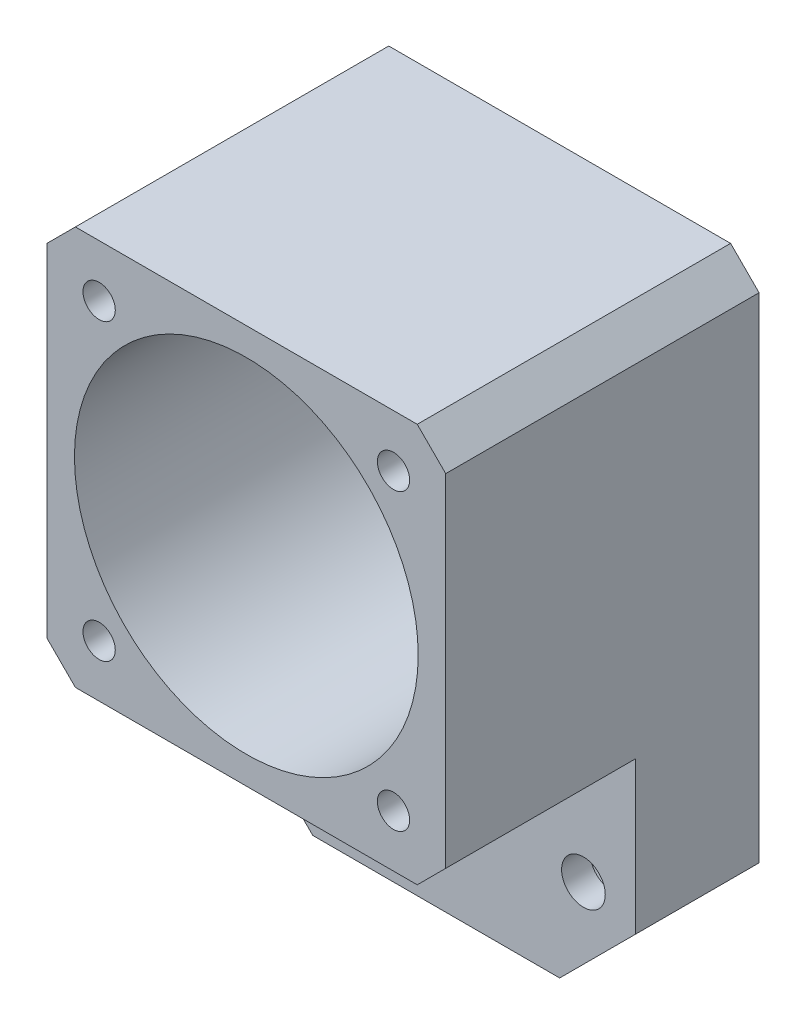
ISO-10303-21;
HEADER;
FILE_DESCRIPTION(('STEP AP214'),'2;1');
FILE_NAME('part.step','',(''),(''),'','','');
FILE_SCHEMA(('AUTOMOTIVE_DESIGN { 1 0 10303 214 1 1 1 1 }'));
ENDSEC;
DATA;
#1=APPLICATION_CONTEXT('core data for automotive mechanical design processes');
#2=APPLICATION_PROTOCOL_DEFINITION('international standard','automotive_design',2000,#1);
#3=PRODUCT_CONTEXT('',#1,'mechanical');
#4=PRODUCT('Part','Part','',(#3));
#5=PRODUCT_RELATED_PRODUCT_CATEGORY('part','',(#4));
#6=PRODUCT_DEFINITION_FORMATION('','',#4);
#7=PRODUCT_DEFINITION_CONTEXT('part definition',#1,'design');
#8=PRODUCT_DEFINITION('design','',#6,#7);
#9=PRODUCT_DEFINITION_SHAPE('','',#8);
#10=(LENGTH_UNIT() NAMED_UNIT(*) SI_UNIT(.MILLI.,.METRE.));
#11=(NAMED_UNIT(*) PLANE_ANGLE_UNIT() SI_UNIT($,.RADIAN.));
#12=(NAMED_UNIT(*) SI_UNIT($,.STERADIAN.) SOLID_ANGLE_UNIT());
#13=UNCERTAINTY_MEASURE_WITH_UNIT(LENGTH_MEASURE(1.E-05),#10,'distance_accuracy_value','');
#14=(GEOMETRIC_REPRESENTATION_CONTEXT(3) GLOBAL_UNCERTAINTY_ASSIGNED_CONTEXT((#13)) GLOBAL_UNIT_ASSIGNED_CONTEXT((#10,
#11,#12)) REPRESENTATION_CONTEXT('',''));
#15=CARTESIAN_POINT('',(0.,0.,0.));
#16=DIRECTION('',(0.,0.,1.));
#17=DIRECTION('',(1.,0.,0.));
#18=AXIS2_PLACEMENT_3D('',#15,#16,#17);
#19=CARTESIAN_POINT('',(0.,0.,13.));
#20=DIRECTION('',(0.,0.,1.));
#21=DIRECTION('',(1.,0.,0.));
#22=AXIS2_PLACEMENT_3D('',#19,#20,#21);
#23=PLANE('',#22);
#24=DIRECTION('',(0.,-1.,0.));
#25=VECTOR('',#24,1.);
#26=CARTESIAN_POINT('',(-21.,21.,13.));
#27=LINE('',#26,#25);
#28=CARTESIAN_POINT('',(-21.,-18.,13.));
#29=VERTEX_POINT('',#28);
#30=CARTESIAN_POINT('',(-21.,-34.,13.));
#31=VERTEX_POINT('',#30);
#32=EDGE_CURVE('E174',#29,#31,#27,.T.);
#33=ORIENTED_EDGE('',*,*,#32,.T.);
#34=DIRECTION('',(-0.707106781186546,0.707106781186549,0.));
#35=VECTOR('',#34,1.);
#36=CARTESIAN_POINT('',(-27.5,-27.4999999999999,13.));
#37=LINE('',#36,#35);
#38=CARTESIAN_POINT('',(-13.,-42.,13.));
#39=VERTEX_POINT('',#38);
#40=EDGE_CURVE('E45',#31,#39,#37,.F.);
#41=ORIENTED_EDGE('',*,*,#40,.T.);
#42=DIRECTION('',(1.,0.,0.));
#43=VECTOR('',#42,1.);
#44=CARTESIAN_POINT('',(-21.,-42.,13.));
#45=LINE('',#44,#43);
#46=CARTESIAN_POINT('',(13.,-42.,13.));
#47=VERTEX_POINT('',#46);
#48=EDGE_CURVE('E176',#39,#47,#45,.T.);
#49=ORIENTED_EDGE('',*,*,#48,.T.);
#50=DIRECTION('',(-0.707106781186548,-0.707106781186547,0.));
#51=VECTOR('',#50,1.);
#52=CARTESIAN_POINT('',(27.5,-27.5,13.));
#53=LINE('',#52,#51);
#54=CARTESIAN_POINT('',(21.,-34.,13.));
#55=VERTEX_POINT('',#54);
#56=EDGE_CURVE('E52',#47,#55,#53,.F.);
#57=ORIENTED_EDGE('',*,*,#56,.T.);
#58=DIRECTION('',(0.,1.,0.));
#59=VECTOR('',#58,1.);
#60=CARTESIAN_POINT('',(21.,21.,13.));
#61=LINE('',#60,#59);
#62=CARTESIAN_POINT('',(21.,-18.,13.));
#63=VERTEX_POINT('',#62);
#64=EDGE_CURVE('E179',#55,#63,#61,.T.);
#65=ORIENTED_EDGE('',*,*,#64,.T.);
#66=DIRECTION('',(0.707106781186548,0.707106781186547,0.));
#67=VECTOR('',#66,1.);
#68=CARTESIAN_POINT('',(21.,-18.,13.));
#69=LINE('',#68,#67);
#70=CARTESIAN_POINT('',(18.,-21.,13.));
#71=VERTEX_POINT('',#70);
#72=EDGE_CURVE('E136',#63,#71,#69,.F.);
#73=ORIENTED_EDGE('',*,*,#72,.T.);
#74=DIRECTION('',(1.,0.,0.));
#75=VECTOR('',#74,1.);
#76=CARTESIAN_POINT('',(-21.,-21.,13.));
#77=LINE('',#76,#75);
#78=CARTESIAN_POINT('',(-18.,-21.,13.));
#79=VERTEX_POINT('',#78);
#80=EDGE_CURVE('E143',#79,#71,#77,.T.);
#81=ORIENTED_EDGE('',*,*,#80,.F.);
#82=DIRECTION('',(0.707106781186546,-0.707106781186549,0.));
#83=VECTOR('',#82,1.);
#84=CARTESIAN_POINT('',(-18.,-21.,13.));
#85=LINE('',#84,#83);
#86=EDGE_CURVE('E129',#79,#29,#85,.F.);
#87=ORIENTED_EDGE('',*,*,#86,.T.);
#88=EDGE_LOOP('',(#33,#41,#49,#57,#65,#73,#81,#87));
#89=FACE_BOUND('',#88,.T.);
#90=CARTESIAN_POINT('',(-15.5,-32.,13.));
#91=DIRECTION('',(0.,0.,1.));
#92=DIRECTION('',(1.,0.,0.));
#93=AXIS2_PLACEMENT_3D('',#90,#91,#92);
#94=CIRCLE('',#93,2.3);
#95=CARTESIAN_POINT('',(-13.2,-32.,13.));
#96=VERTEX_POINT('',#95);
#97=EDGE_CURVE('E167',#96,#96,#94,.T.);
#98=ORIENTED_EDGE('',*,*,#97,.F.);
#99=EDGE_LOOP('',(#98));
#100=FACE_BOUND('',#99,.T.);
#101=CARTESIAN_POINT('',(15.5,-32.,13.));
#102=DIRECTION('',(0.,0.,1.));
#103=DIRECTION('',(1.,0.,0.));
#104=AXIS2_PLACEMENT_3D('',#101,#102,#103);
#105=CIRCLE('',#104,2.3);
#106=CARTESIAN_POINT('',(17.8,-32.,13.));
#107=VERTEX_POINT('',#106);
#108=EDGE_CURVE('E164',#107,#107,#105,.T.);
#109=ORIENTED_EDGE('',*,*,#108,.F.);
#110=EDGE_LOOP('',(#109));
#111=FACE_BOUND('',#110,.T.);
#112=ADVANCED_FACE('F37',(#89,#100,#111),#23,.T.);
#113=CARTESIAN_POINT('',(0.,0.,0.));
#114=DIRECTION('',(0.,0.,1.));
#115=DIRECTION('',(1.,0.,0.));
#116=AXIS2_PLACEMENT_3D('',#113,#114,#115);
#117=PLANE('',#116);
#118=CARTESIAN_POINT('',(15.5,15.5,0.));
#119=DIRECTION('',(0.,0.,1.));
#120=DIRECTION('',(1.,0.,0.));
#121=AXIS2_PLACEMENT_3D('',#118,#119,#120);
#122=CIRCLE('',#121,2.9);
#123=CARTESIAN_POINT('',(18.4,15.5,0.));
#124=VERTEX_POINT('',#123);
#125=EDGE_CURVE('E662',#124,#124,#122,.T.);
#126=ORIENTED_EDGE('',*,*,#125,.T.);
#127=EDGE_LOOP('',(#126));
#128=FACE_BOUND('',#127,.T.);
#129=CARTESIAN_POINT('',(-15.5,-15.5,0.));
#130=DIRECTION('',(0.,0.,1.));
#131=DIRECTION('',(1.,0.,0.));
#132=AXIS2_PLACEMENT_3D('',#129,#130,#131);
#133=CIRCLE('',#132,2.9);
#134=CARTESIAN_POINT('',(-12.6,-15.5,0.));
#135=VERTEX_POINT('',#134);
#136=EDGE_CURVE('E655',#135,#135,#133,.T.);
#137=ORIENTED_EDGE('',*,*,#136,.T.);
#138=EDGE_LOOP('',(#137));
#139=FACE_BOUND('',#138,.T.);
#140=CARTESIAN_POINT('',(15.5,-15.5,0.));
#141=DIRECTION('',(0.,0.,1.));
#142=DIRECTION('',(1.,0.,0.));
#143=AXIS2_PLACEMENT_3D('',#140,#141,#142);
#144=CIRCLE('',#143,2.9);
#145=CARTESIAN_POINT('',(18.4,-15.5,0.));
#146=VERTEX_POINT('',#145);
#147=EDGE_CURVE('E656',#146,#146,#144,.T.);
#148=ORIENTED_EDGE('',*,*,#147,.T.);
#149=EDGE_LOOP('',(#148));
#150=FACE_BOUND('',#149,.T.);
#151=CARTESIAN_POINT('',(-15.5,15.5,0.));
#152=DIRECTION('',(0.,0.,1.));
#153=DIRECTION('',(1.,0.,0.));
#154=AXIS2_PLACEMENT_3D('',#151,#152,#153);
#155=CIRCLE('',#154,2.9);
#156=CARTESIAN_POINT('',(-12.6,15.5,0.));
#157=VERTEX_POINT('',#156);
#158=EDGE_CURVE('E214',#157,#157,#155,.T.);
#159=ORIENTED_EDGE('',*,*,#158,.T.);
#160=EDGE_LOOP('',(#159));
#161=FACE_BOUND('',#160,.T.);
#162=CARTESIAN_POINT('',(15.5,-32.,0.));
#163=DIRECTION('',(0.,0.,1.));
#164=DIRECTION('',(1.,0.,0.));
#165=AXIS2_PLACEMENT_3D('',#162,#163,#164);
#166=CIRCLE('',#165,4.);
#167=CARTESIAN_POINT('',(19.5,-32.,0.));
#168=VERTEX_POINT('',#167);
#169=EDGE_CURVE('E202',#168,#168,#166,.T.);
#170=ORIENTED_EDGE('',*,*,#169,.T.);
#171=EDGE_LOOP('',(#170));
#172=FACE_BOUND('',#171,.T.);
#173=CARTESIAN_POINT('',(-15.5,-32.,0.));
#174=DIRECTION('',(0.,0.,1.));
#175=DIRECTION('',(1.,0.,0.));
#176=AXIS2_PLACEMENT_3D('',#173,#174,#175);
#177=CIRCLE('',#176,4.);
#178=CARTESIAN_POINT('',(-11.5,-32.,0.));
#179=VERTEX_POINT('',#178);
#180=EDGE_CURVE('E197',#179,#179,#177,.T.);
#181=ORIENTED_EDGE('',*,*,#180,.T.);
#182=EDGE_LOOP('',(#181));
#183=FACE_BOUND('',#182,.T.);
#184=DIRECTION('',(1.,0.,0.));
#185=VECTOR('',#184,1.);
#186=CARTESIAN_POINT('',(-21.,-42.,0.));
#187=LINE('',#186,#185);
#188=CARTESIAN_POINT('',(-13.,-42.,0.));
#189=VERTEX_POINT('',#188);
#190=CARTESIAN_POINT('',(13.,-42.,0.));
#191=VERTEX_POINT('',#190);
#192=EDGE_CURVE('E182',#189,#191,#187,.T.);
#193=ORIENTED_EDGE('',*,*,#192,.F.);
#194=DIRECTION('',(0.707106781186546,-0.707106781186549,0.));
#195=VECTOR('',#194,1.);
#196=CARTESIAN_POINT('',(-13.,-42.,0.));
#197=LINE('',#196,#195);
#198=CARTESIAN_POINT('',(-21.,-34.,0.));
#199=VERTEX_POINT('',#198);
#200=EDGE_CURVE('E249',#189,#199,#197,.F.);
#201=ORIENTED_EDGE('',*,*,#200,.T.);
#202=DIRECTION('',(0.,-1.,0.));
#203=VECTOR('',#202,1.);
#204=CARTESIAN_POINT('',(-21.,21.,0.));
#205=LINE('',#204,#203);
#206=CARTESIAN_POINT('',(-21.,18.,0.));
#207=VERTEX_POINT('',#206);
#208=EDGE_CURVE('E173',#207,#199,#205,.T.);
#209=ORIENTED_EDGE('',*,*,#208,.F.);
#210=DIRECTION('',(-0.707106781186548,-0.707106781186547,0.));
#211=VECTOR('',#210,1.);
#212=CARTESIAN_POINT('',(-21.,18.,0.));
#213=LINE('',#212,#211);
#214=CARTESIAN_POINT('',(-18.,21.,0.));
#215=VERTEX_POINT('',#214);
#216=EDGE_CURVE('E230',#207,#215,#213,.F.);
#217=ORIENTED_EDGE('',*,*,#216,.T.);
#218=DIRECTION('',(-1.,0.,0.));
#219=VECTOR('',#218,1.);
#220=CARTESIAN_POINT('',(-21.,21.,0.));
#221=LINE('',#220,#219);
#222=CARTESIAN_POINT('',(18.,21.,0.));
#223=VERTEX_POINT('',#222);
#224=EDGE_CURVE('E177',#223,#215,#221,.T.);
#225=ORIENTED_EDGE('',*,*,#224,.F.);
#226=DIRECTION('',(-0.707106781186547,0.707106781186548,0.));
#227=VECTOR('',#226,1.);
#228=CARTESIAN_POINT('',(18.,21.,0.));
#229=LINE('',#228,#227);
#230=CARTESIAN_POINT('',(21.,18.,0.));
#231=VERTEX_POINT('',#230);
#232=EDGE_CURVE('E227',#223,#231,#229,.F.);
#233=ORIENTED_EDGE('',*,*,#232,.T.);
#234=DIRECTION('',(0.,1.,0.));
#235=VECTOR('',#234,1.);
#236=CARTESIAN_POINT('',(21.,21.,0.));
#237=LINE('',#236,#235);
#238=CARTESIAN_POINT('',(21.,-34.,0.));
#239=VERTEX_POINT('',#238);
#240=EDGE_CURVE('E185',#239,#231,#237,.T.);
#241=ORIENTED_EDGE('',*,*,#240,.F.);
#242=DIRECTION('',(0.707106781186548,0.707106781186547,0.));
#243=VECTOR('',#242,1.);
#244=CARTESIAN_POINT('',(21.,-34.,0.));
#245=LINE('',#244,#243);
#246=EDGE_CURVE('E247',#239,#191,#245,.F.);
#247=ORIENTED_EDGE('',*,*,#246,.T.);
#248=EDGE_LOOP('',(#193,#201,#209,#217,#225,#233,#241,#247));
#249=FACE_BOUND('',#248,.T.);
#250=CARTESIAN_POINT('',(0.,0.,0.));
#251=DIRECTION('',(0.,0.,1.));
#252=DIRECTION('',(1.,0.,0.));
#253=AXIS2_PLACEMENT_3D('',#250,#251,#252);
#254=CIRCLE('',#253,18.1);
#255=CARTESIAN_POINT('',(18.1,0.,0.));
#256=VERTEX_POINT('',#255);
#257=EDGE_CURVE('E170',#256,#256,#254,.T.);
#258=ORIENTED_EDGE('',*,*,#257,.T.);
#259=EDGE_LOOP('',(#258));
#260=FACE_BOUND('',#259,.T.);
#261=ADVANCED_FACE('F263',(#128,#139,#150,#161,#172,#183,#249,#260),#117,.F.);
#262=CARTESIAN_POINT('',(-21.,21.,13.));
#263=DIRECTION('',(1.,0.,0.));
#264=DIRECTION('',(0.,1.,0.));
#265=AXIS2_PLACEMENT_3D('',#262,#263,#264);
#266=PLANE('',#265);
#267=ORIENTED_EDGE('',*,*,#208,.T.);
#268=DIRECTION('',(0.,0.,1.));
#269=VECTOR('',#268,1.);
#270=CARTESIAN_POINT('',(-21.,-34.,13.));
#271=LINE('',#270,#269);
#272=EDGE_CURVE('E60',#199,#31,#271,.T.);
#273=ORIENTED_EDGE('',*,*,#272,.T.);
#274=ORIENTED_EDGE('',*,*,#32,.F.);
#275=DIRECTION('',(0.,0.,1.));
#276=VECTOR('',#275,1.);
#277=CARTESIAN_POINT('',(-21.,-18.,13.));
#278=LINE('',#277,#276);
#279=CARTESIAN_POINT('',(-21.,-18.,33.));
#280=VERTEX_POINT('',#279);
#281=EDGE_CURVE('E134',#29,#280,#278,.T.);
#282=ORIENTED_EDGE('',*,*,#281,.T.);
#283=DIRECTION('',(0.,-1.,0.));
#284=VECTOR('',#283,1.);
#285=CARTESIAN_POINT('',(-21.,21.,33.));
#286=LINE('',#285,#284);
#287=CARTESIAN_POINT('',(-21.,18.,33.));
#288=VERTEX_POINT('',#287);
#289=EDGE_CURVE('E152',#288,#280,#286,.T.);
#290=ORIENTED_EDGE('',*,*,#289,.F.);
#291=DIRECTION('',(0.,0.,-1.));
#292=VECTOR('',#291,1.);
#293=CARTESIAN_POINT('',(-21.,18.,13.));
#294=LINE('',#293,#292);
#295=EDGE_CURVE('E147',#288,#207,#294,.T.);
#296=ORIENTED_EDGE('',*,*,#295,.T.);
#297=EDGE_LOOP('',(#267,#273,#274,#282,#290,#296));
#298=FACE_BOUND('',#297,.T.);
#299=ADVANCED_FACE('F265',(#298),#266,.F.);
#300=CARTESIAN_POINT('',(-21.,-42.,13.));
#301=DIRECTION('',(0.,1.,0.));
#302=DIRECTION('',(0.,0.,1.));
#303=AXIS2_PLACEMENT_3D('',#300,#301,#302);
#304=PLANE('',#303);
#305=ORIENTED_EDGE('',*,*,#48,.F.);
#306=DIRECTION('',(0.,0.,-1.));
#307=VECTOR('',#306,1.);
#308=CARTESIAN_POINT('',(-13.,-42.,13.));
#309=LINE('',#308,#307);
#310=EDGE_CURVE('E244',#39,#189,#309,.T.);
#311=ORIENTED_EDGE('',*,*,#310,.T.);
#312=ORIENTED_EDGE('',*,*,#192,.T.);
#313=DIRECTION('',(0.,0.,1.));
#314=VECTOR('',#313,1.);
#315=CARTESIAN_POINT('',(13.,-42.,13.));
#316=LINE('',#315,#314);
#317=EDGE_CURVE('E242',#191,#47,#316,.T.);
#318=ORIENTED_EDGE('',*,*,#317,.T.);
#319=EDGE_LOOP('',(#305,#311,#312,#318));
#320=FACE_BOUND('',#319,.T.);
#321=ADVANCED_FACE('F257',(#320),#304,.F.);
#322=CARTESIAN_POINT('',(21.,21.,13.));
#323=DIRECTION('',(-1.,0.,0.));
#324=DIRECTION('',(0.,-1.,0.));
#325=AXIS2_PLACEMENT_3D('',#322,#323,#324);
#326=PLANE('',#325);
#327=ORIENTED_EDGE('',*,*,#64,.F.);
#328=DIRECTION('',(0.,0.,-1.));
#329=VECTOR('',#328,1.);
#330=CARTESIAN_POINT('',(21.,-34.,13.));
#331=LINE('',#330,#329);
#332=EDGE_CURVE('E12',#55,#239,#331,.T.);
#333=ORIENTED_EDGE('',*,*,#332,.T.);
#334=ORIENTED_EDGE('',*,*,#240,.T.);
#335=DIRECTION('',(0.,0.,1.));
#336=VECTOR('',#335,1.);
#337=CARTESIAN_POINT('',(21.,18.,13.));
#338=LINE('',#337,#336);
#339=CARTESIAN_POINT('',(21.,18.,33.));
#340=VERTEX_POINT('',#339);
#341=EDGE_CURVE('E237',#231,#340,#338,.T.);
#342=ORIENTED_EDGE('',*,*,#341,.T.);
#343=DIRECTION('',(0.,1.,0.));
#344=VECTOR('',#343,1.);
#345=CARTESIAN_POINT('',(21.,21.,33.));
#346=LINE('',#345,#344);
#347=CARTESIAN_POINT('',(21.,-18.,33.));
#348=VERTEX_POINT('',#347);
#349=EDGE_CURVE('E626',#348,#340,#346,.T.);
#350=ORIENTED_EDGE('',*,*,#349,.F.);
#351=DIRECTION('',(0.,0.,-1.));
#352=VECTOR('',#351,1.);
#353=CARTESIAN_POINT('',(21.,-18.,13.));
#354=LINE('',#353,#352);
#355=EDGE_CURVE('E137',#348,#63,#354,.T.);
#356=ORIENTED_EDGE('',*,*,#355,.T.);
#357=EDGE_LOOP('',(#327,#333,#334,#342,#350,#356));
#358=FACE_BOUND('',#357,.T.);
#359=ADVANCED_FACE('F284',(#358),#326,.F.);
#360=CARTESIAN_POINT('',(-21.,21.,13.));
#361=DIRECTION('',(0.,-1.,0.));
#362=DIRECTION('',(0.,0.,-1.));
#363=AXIS2_PLACEMENT_3D('',#360,#361,#362);
#364=PLANE('',#363);
#365=ORIENTED_EDGE('',*,*,#224,.T.);
#366=DIRECTION('',(0.,0.,1.));
#367=VECTOR('',#366,1.);
#368=CARTESIAN_POINT('',(-18.,21.,13.));
#369=LINE('',#368,#367);
#370=CARTESIAN_POINT('',(-18.,21.,33.));
#371=VERTEX_POINT('',#370);
#372=EDGE_CURVE('E235',#215,#371,#369,.T.);
#373=ORIENTED_EDGE('',*,*,#372,.T.);
#374=DIRECTION('',(-1.,0.,0.));
#375=VECTOR('',#374,1.);
#376=CARTESIAN_POINT('',(-21.,21.,33.));
#377=LINE('',#376,#375);
#378=CARTESIAN_POINT('',(18.,21.,33.));
#379=VERTEX_POINT('',#378);
#380=EDGE_CURVE('E162',#379,#371,#377,.T.);
#381=ORIENTED_EDGE('',*,*,#380,.F.);
#382=DIRECTION('',(0.,0.,-1.));
#383=VECTOR('',#382,1.);
#384=CARTESIAN_POINT('',(18.,21.,13.));
#385=LINE('',#384,#383);
#386=EDGE_CURVE('E232',#379,#223,#385,.T.);
#387=ORIENTED_EDGE('',*,*,#386,.T.);
#388=EDGE_LOOP('',(#365,#373,#381,#387));
#389=FACE_BOUND('',#388,.T.);
#390=ADVANCED_FACE('F274',(#389),#364,.F.);
#391=CARTESIAN_POINT('',(0.,0.,13.));
#392=DIRECTION('',(0.,0.,-1.));
#393=DIRECTION('',(-1.,0.,0.));
#394=AXIS2_PLACEMENT_3D('',#391,#392,#393);
#395=CYLINDRICAL_SURFACE('',#394,18.1);
#396=ORIENTED_EDGE('',*,*,#257,.F.);
#397=EDGE_LOOP('',(#396));
#398=FACE_BOUND('',#397,.T.);
#399=CARTESIAN_POINT('',(0.,0.,33.));
#400=DIRECTION('',(0.,0.,1.));
#401=DIRECTION('',(1.,0.,0.));
#402=AXIS2_PLACEMENT_3D('',#399,#400,#401);
#403=CIRCLE('',#402,18.1);
#404=CARTESIAN_POINT('',(18.1,0.,33.));
#405=VERTEX_POINT('',#404);
#406=EDGE_CURVE('E153',#405,#405,#403,.T.);
#407=ORIENTED_EDGE('',*,*,#406,.T.);
#408=EDGE_LOOP('',(#407));
#409=FACE_BOUND('',#408,.T.);
#410=ADVANCED_FACE('F301',(#398,#409),#395,.F.);
#411=CARTESIAN_POINT('',(-15.5,15.5,13.));
#412=DIRECTION('',(0.,0.,-1.));
#413=DIRECTION('',(-1.,0.,0.));
#414=AXIS2_PLACEMENT_3D('',#411,#412,#413);
#415=CYLINDRICAL_SURFACE('',#414,1.7);
#416=CARTESIAN_POINT('',(-15.5,15.5,30.));
#417=DIRECTION('',(0.,0.,1.));
#418=DIRECTION('',(1.,0.,0.));
#419=AXIS2_PLACEMENT_3D('',#416,#417,#418);
#420=CIRCLE('',#419,1.7);
#421=CARTESIAN_POINT('',(-13.8,15.5,30.));
#422=VERTEX_POINT('',#421);
#423=EDGE_CURVE('E199',#422,#422,#420,.T.);
#424=ORIENTED_EDGE('',*,*,#423,.F.);
#425=EDGE_LOOP('',(#424));
#426=FACE_BOUND('',#425,.T.);
#427=CARTESIAN_POINT('',(-15.5,15.5,33.));
#428=DIRECTION('',(0.,0.,1.));
#429=DIRECTION('',(1.,0.,0.));
#430=AXIS2_PLACEMENT_3D('',#427,#428,#429);
#431=CIRCLE('',#430,1.7);
#432=CARTESIAN_POINT('',(-13.8,15.5,33.));
#433=VERTEX_POINT('',#432);
#434=EDGE_CURVE('E192',#433,#433,#431,.T.);
#435=ORIENTED_EDGE('',*,*,#434,.T.);
#436=EDGE_LOOP('',(#435));
#437=FACE_BOUND('',#436,.T.);
#438=ADVANCED_FACE('F422',(#426,#437),#415,.F.);
#439=CARTESIAN_POINT('',(15.5,15.5,13.));
#440=DIRECTION('',(0.,0.,-1.));
#441=DIRECTION('',(-1.,0.,0.));
#442=AXIS2_PLACEMENT_3D('',#439,#440,#441);
#443=CYLINDRICAL_SURFACE('',#442,1.7);
#444=CARTESIAN_POINT('',(15.5,15.5,30.));
#445=DIRECTION('',(0.,0.,1.));
#446=DIRECTION('',(1.,0.,0.));
#447=AXIS2_PLACEMENT_3D('',#444,#445,#446);
#448=CIRCLE('',#447,1.7);
#449=CARTESIAN_POINT('',(17.2,15.5,30.));
#450=VERTEX_POINT('',#449);
#451=EDGE_CURVE('E211',#450,#450,#448,.T.);
#452=ORIENTED_EDGE('',*,*,#451,.F.);
#453=EDGE_LOOP('',(#452));
#454=FACE_BOUND('',#453,.T.);
#455=CARTESIAN_POINT('',(15.5,15.5,33.));
#456=DIRECTION('',(0.,0.,1.));
#457=DIRECTION('',(1.,0.,0.));
#458=AXIS2_PLACEMENT_3D('',#455,#456,#457);
#459=CIRCLE('',#458,1.7);
#460=CARTESIAN_POINT('',(17.2,15.5,33.));
#461=VERTEX_POINT('',#460);
#462=EDGE_CURVE('E158',#461,#461,#459,.T.);
#463=ORIENTED_EDGE('',*,*,#462,.T.);
#464=EDGE_LOOP('',(#463));
#465=FACE_BOUND('',#464,.T.);
#466=ADVANCED_FACE('F411',(#454,#465),#443,.F.);
#467=CARTESIAN_POINT('',(-15.5,-15.5,13.));
#468=DIRECTION('',(0.,0.,-1.));
#469=DIRECTION('',(-1.,0.,0.));
#470=AXIS2_PLACEMENT_3D('',#467,#468,#469);
#471=CYLINDRICAL_SURFACE('',#470,1.7);
#472=CARTESIAN_POINT('',(-15.5,-15.5,30.));
#473=DIRECTION('',(0.,0.,1.));
#474=DIRECTION('',(1.,0.,0.));
#475=AXIS2_PLACEMENT_3D('',#472,#473,#474);
#476=CIRCLE('',#475,1.7);
#477=CARTESIAN_POINT('',(-13.8,-15.5,30.));
#478=VERTEX_POINT('',#477);
#479=EDGE_CURVE('E207',#478,#478,#476,.T.);
#480=ORIENTED_EDGE('',*,*,#479,.F.);
#481=EDGE_LOOP('',(#480));
#482=FACE_BOUND('',#481,.T.);
#483=CARTESIAN_POINT('',(-15.5,-15.5,33.));
#484=DIRECTION('',(0.,0.,1.));
#485=DIRECTION('',(1.,0.,0.));
#486=AXIS2_PLACEMENT_3D('',#483,#484,#485);
#487=CIRCLE('',#486,1.7);
#488=CARTESIAN_POINT('',(-13.8,-15.5,33.));
#489=VERTEX_POINT('',#488);
#490=EDGE_CURVE('E618',#489,#489,#487,.T.);
#491=ORIENTED_EDGE('',*,*,#490,.T.);
#492=EDGE_LOOP('',(#491));
#493=FACE_BOUND('',#492,.T.);
#494=ADVANCED_FACE('F399',(#482,#493),#471,.F.);
#495=CARTESIAN_POINT('',(15.5,-15.5,13.));
#496=DIRECTION('',(0.,0.,-1.));
#497=DIRECTION('',(-1.,0.,0.));
#498=AXIS2_PLACEMENT_3D('',#495,#496,#497);
#499=CYLINDRICAL_SURFACE('',#498,1.7);
#500=CARTESIAN_POINT('',(15.5,-15.5,30.));
#501=DIRECTION('',(0.,0.,1.));
#502=DIRECTION('',(1.,0.,0.));
#503=AXIS2_PLACEMENT_3D('',#500,#501,#502);
#504=CIRCLE('',#503,1.7);
#505=CARTESIAN_POINT('',(17.2,-15.5,30.));
#506=VERTEX_POINT('',#505);
#507=EDGE_CURVE('E204',#506,#506,#504,.T.);
#508=ORIENTED_EDGE('',*,*,#507,.F.);
#509=EDGE_LOOP('',(#508));
#510=FACE_BOUND('',#509,.T.);
#511=CARTESIAN_POINT('',(15.5,-15.5,33.));
#512=DIRECTION('',(0.,0.,1.));
#513=DIRECTION('',(1.,0.,0.));
#514=AXIS2_PLACEMENT_3D('',#511,#512,#513);
#515=CIRCLE('',#514,1.7);
#516=CARTESIAN_POINT('',(17.2,-15.5,33.));
#517=VERTEX_POINT('',#516);
#518=EDGE_CURVE('E621',#517,#517,#515,.T.);
#519=ORIENTED_EDGE('',*,*,#518,.T.);
#520=EDGE_LOOP('',(#519));
#521=FACE_BOUND('',#520,.T.);
#522=ADVANCED_FACE('F389',(#510,#521),#499,.F.);
#523=CARTESIAN_POINT('',(-15.5,-32.,13.));
#524=DIRECTION('',(0.,0.,-1.));
#525=DIRECTION('',(-1.,0.,0.));
#526=AXIS2_PLACEMENT_3D('',#523,#524,#525);
#527=CYLINDRICAL_SURFACE('',#526,2.3);
#528=CARTESIAN_POINT('',(-15.5,-32.,10.));
#529=DIRECTION('',(0.,0.,1.));
#530=DIRECTION('',(1.,0.,0.));
#531=AXIS2_PLACEMENT_3D('',#528,#529,#530);
#532=CIRCLE('',#531,2.3);
#533=CARTESIAN_POINT('',(-13.2,-32.,10.));
#534=VERTEX_POINT('',#533);
#535=EDGE_CURVE('E189',#534,#534,#532,.T.);
#536=ORIENTED_EDGE('',*,*,#535,.F.);
#537=EDGE_LOOP('',(#536));
#538=FACE_BOUND('',#537,.T.);
#539=ORIENTED_EDGE('',*,*,#97,.T.);
#540=EDGE_LOOP('',(#539));
#541=FACE_BOUND('',#540,.T.);
#542=ADVANCED_FACE('F379',(#538,#541),#527,.F.);
#543=CARTESIAN_POINT('',(15.5,-32.,13.));
#544=DIRECTION('',(0.,0.,-1.));
#545=DIRECTION('',(-1.,0.,0.));
#546=AXIS2_PLACEMENT_3D('',#543,#544,#545);
#547=CYLINDRICAL_SURFACE('',#546,2.3);
#548=CARTESIAN_POINT('',(15.5,-32.,10.));
#549=DIRECTION('',(0.,0.,1.));
#550=DIRECTION('',(1.,0.,0.));
#551=AXIS2_PLACEMENT_3D('',#548,#549,#550);
#552=CIRCLE('',#551,2.3);
#553=CARTESIAN_POINT('',(17.8,-32.,10.));
#554=VERTEX_POINT('',#553);
#555=EDGE_CURVE('E194',#554,#554,#552,.T.);
#556=ORIENTED_EDGE('',*,*,#555,.F.);
#557=EDGE_LOOP('',(#556));
#558=FACE_BOUND('',#557,.T.);
#559=ORIENTED_EDGE('',*,*,#108,.T.);
#560=EDGE_LOOP('',(#559));
#561=FACE_BOUND('',#560,.T.);
#562=ADVANCED_FACE('F372',(#558,#561),#547,.F.);
#563=CARTESIAN_POINT('',(0.,0.,33.));
#564=DIRECTION('',(0.,0.,1.));
#565=DIRECTION('',(1.,0.,0.));
#566=AXIS2_PLACEMENT_3D('',#563,#564,#565);
#567=PLANE('',#566);
#568=ORIENTED_EDGE('',*,*,#490,.F.);
#569=EDGE_LOOP('',(#568));
#570=FACE_BOUND('',#569,.T.);
#571=ORIENTED_EDGE('',*,*,#462,.F.);
#572=EDGE_LOOP('',(#571));
#573=FACE_BOUND('',#572,.T.);
#574=ORIENTED_EDGE('',*,*,#289,.T.);
#575=DIRECTION('',(-0.707106781186546,0.707106781186549,0.));
#576=VECTOR('',#575,1.);
#577=CARTESIAN_POINT('',(-19.5,-19.5,33.));
#578=LINE('',#577,#576);
#579=CARTESIAN_POINT('',(-18.,-21.,33.));
#580=VERTEX_POINT('',#579);
#581=EDGE_CURVE('E225',#280,#580,#578,.F.);
#582=ORIENTED_EDGE('',*,*,#581,.T.);
#583=DIRECTION('',(1.,0.,0.));
#584=VECTOR('',#583,1.);
#585=CARTESIAN_POINT('',(-21.,-21.,33.));
#586=LINE('',#585,#584);
#587=CARTESIAN_POINT('',(18.,-21.,33.));
#588=VERTEX_POINT('',#587);
#589=EDGE_CURVE('E146',#580,#588,#586,.T.);
#590=ORIENTED_EDGE('',*,*,#589,.T.);
#591=DIRECTION('',(-0.707106781186548,-0.707106781186547,0.));
#592=VECTOR('',#591,1.);
#593=CARTESIAN_POINT('',(19.5,-19.5,33.));
#594=LINE('',#593,#592);
#595=EDGE_CURVE('E221',#588,#348,#594,.F.);
#596=ORIENTED_EDGE('',*,*,#595,.T.);
#597=ORIENTED_EDGE('',*,*,#349,.T.);
#598=DIRECTION('',(0.707106781186547,-0.707106781186548,0.));
#599=VECTOR('',#598,1.);
#600=CARTESIAN_POINT('',(19.5,19.5,33.));
#601=LINE('',#600,#599);
#602=EDGE_CURVE('E219',#340,#379,#601,.F.);
#603=ORIENTED_EDGE('',*,*,#602,.T.);
#604=ORIENTED_EDGE('',*,*,#380,.T.);
#605=DIRECTION('',(0.707106781186548,0.707106781186547,0.));
#606=VECTOR('',#605,1.);
#607=CARTESIAN_POINT('',(-19.5,19.5,33.));
#608=LINE('',#607,#606);
#609=EDGE_CURVE('E223',#371,#288,#608,.F.);
#610=ORIENTED_EDGE('',*,*,#609,.T.);
#611=EDGE_LOOP('',(#574,#582,#590,#596,#597,#603,#604,#610));
#612=FACE_BOUND('',#611,.T.);
#613=ORIENTED_EDGE('',*,*,#406,.F.);
#614=EDGE_LOOP('',(#613));
#615=FACE_BOUND('',#614,.T.);
#616=ORIENTED_EDGE('',*,*,#518,.F.);
#617=EDGE_LOOP('',(#616));
#618=FACE_BOUND('',#617,.T.);
#619=ORIENTED_EDGE('',*,*,#434,.F.);
#620=EDGE_LOOP('',(#619));
#621=FACE_BOUND('',#620,.T.);
#622=ADVANCED_FACE('F378',(#570,#573,#612,#615,#618,#621),#567,.T.);
#623=CARTESIAN_POINT('',(-21.,-21.,33.));
#624=DIRECTION('',(0.,1.,0.));
#625=DIRECTION('',(0.,0.,1.));
#626=AXIS2_PLACEMENT_3D('',#623,#624,#625);
#627=PLANE('',#626);
#628=ORIENTED_EDGE('',*,*,#589,.F.);
#629=DIRECTION('',(0.,0.,-1.));
#630=VECTOR('',#629,1.);
#631=CARTESIAN_POINT('',(-18.,-21.,33.));
#632=LINE('',#631,#630);
#633=EDGE_CURVE('E133',#580,#79,#632,.T.);
#634=ORIENTED_EDGE('',*,*,#633,.T.);
#635=ORIENTED_EDGE('',*,*,#80,.T.);
#636=DIRECTION('',(0.,0.,1.));
#637=VECTOR('',#636,1.);
#638=CARTESIAN_POINT('',(18.,-21.,33.));
#639=LINE('',#638,#637);
#640=EDGE_CURVE('E148',#71,#588,#639,.T.);
#641=ORIENTED_EDGE('',*,*,#640,.T.);
#642=EDGE_LOOP('',(#628,#634,#635,#641));
#643=FACE_BOUND('',#642,.T.);
#644=ADVANCED_FACE('F142',(#643),#627,.F.);
#645=CARTESIAN_POINT('',(-15.5,-32.,24.3137084989848));
#646=DIRECTION('',(0.,0.,-1.));
#647=DIRECTION('',(-1.,0.,0.));
#648=AXIS2_PLACEMENT_3D('',#645,#646,#647);
#649=CYLINDRICAL_SURFACE('',#648,4.);
#650=ORIENTED_EDGE('',*,*,#180,.F.);
#651=EDGE_LOOP('',(#650));
#652=FACE_BOUND('',#651,.T.);
#653=CARTESIAN_POINT('',(-15.5,-32.,10.));
#654=DIRECTION('',(0.,0.,1.));
#655=DIRECTION('',(1.,0.,0.));
#656=AXIS2_PLACEMENT_3D('',#653,#654,#655);
#657=CIRCLE('',#656,4.);
#658=CARTESIAN_POINT('',(-11.5,-32.,10.));
#659=VERTEX_POINT('',#658);
#660=EDGE_CURVE('E193',#659,#659,#657,.T.);
#661=ORIENTED_EDGE('',*,*,#660,.T.);
#662=EDGE_LOOP('',(#661));
#663=FACE_BOUND('',#662,.T.);
#664=ADVANCED_FACE('F472',(#652,#663),#649,.F.);
#665=CARTESIAN_POINT('',(0.,0.,10.));
#666=DIRECTION('',(0.,0.,1.));
#667=DIRECTION('',(1.,0.,0.));
#668=AXIS2_PLACEMENT_3D('',#665,#666,#667);
#669=PLANE('',#668);
#670=ORIENTED_EDGE('',*,*,#535,.T.);
#671=EDGE_LOOP('',(#670));
#672=FACE_BOUND('',#671,.T.);
#673=ORIENTED_EDGE('',*,*,#660,.F.);
#674=EDGE_LOOP('',(#673));
#675=FACE_BOUND('',#674,.T.);
#676=ADVANCED_FACE('F567',(#672,#675),#669,.F.);
#677=CARTESIAN_POINT('',(15.5,-32.,24.3137084989848));
#678=DIRECTION('',(0.,0.,-1.));
#679=DIRECTION('',(-1.,0.,0.));
#680=AXIS2_PLACEMENT_3D('',#677,#678,#679);
#681=CYLINDRICAL_SURFACE('',#680,4.);
#682=ORIENTED_EDGE('',*,*,#169,.F.);
#683=EDGE_LOOP('',(#682));
#684=FACE_BOUND('',#683,.T.);
#685=CARTESIAN_POINT('',(15.5,-32.,10.));
#686=DIRECTION('',(0.,0.,1.));
#687=DIRECTION('',(1.,0.,0.));
#688=AXIS2_PLACEMENT_3D('',#685,#686,#687);
#689=CIRCLE('',#688,4.);
#690=CARTESIAN_POINT('',(19.5,-32.,10.));
#691=VERTEX_POINT('',#690);
#692=EDGE_CURVE('E198',#691,#691,#689,.T.);
#693=ORIENTED_EDGE('',*,*,#692,.T.);
#694=EDGE_LOOP('',(#693));
#695=FACE_BOUND('',#694,.T.);
#696=ADVANCED_FACE('F559',(#684,#695),#681,.F.);
#697=CARTESIAN_POINT('',(0.,0.,10.));
#698=DIRECTION('',(0.,0.,1.));
#699=DIRECTION('',(1.,0.,0.));
#700=AXIS2_PLACEMENT_3D('',#697,#698,#699);
#701=PLANE('',#700);
#702=ORIENTED_EDGE('',*,*,#555,.T.);
#703=EDGE_LOOP('',(#702));
#704=FACE_BOUND('',#703,.T.);
#705=ORIENTED_EDGE('',*,*,#692,.F.);
#706=EDGE_LOOP('',(#705));
#707=FACE_BOUND('',#706,.T.);
#708=ADVANCED_FACE('F551',(#704,#707),#701,.F.);
#709=CARTESIAN_POINT('',(-15.5,15.5,41.202438661764));
#710=DIRECTION('',(0.,0.,-1.));
#711=DIRECTION('',(-1.,0.,0.));
#712=AXIS2_PLACEMENT_3D('',#709,#710,#711);
#713=CYLINDRICAL_SURFACE('',#712,2.9);
#714=ORIENTED_EDGE('',*,*,#158,.F.);
#715=EDGE_LOOP('',(#714));
#716=FACE_BOUND('',#715,.T.);
#717=CARTESIAN_POINT('',(-15.5,15.5,30.));
#718=DIRECTION('',(0.,0.,1.));
#719=DIRECTION('',(1.,0.,0.));
#720=AXIS2_PLACEMENT_3D('',#717,#718,#719);
#721=CIRCLE('',#720,2.9);
#722=CARTESIAN_POINT('',(-12.6,15.5,30.));
#723=VERTEX_POINT('',#722);
#724=EDGE_CURVE('E203',#723,#723,#721,.T.);
#725=ORIENTED_EDGE('',*,*,#724,.T.);
#726=EDGE_LOOP('',(#725));
#727=FACE_BOUND('',#726,.T.);
#728=ADVANCED_FACE('F543',(#716,#727),#713,.F.);
#729=CARTESIAN_POINT('',(0.,0.,30.));
#730=DIRECTION('',(0.,0.,1.));
#731=DIRECTION('',(1.,0.,0.));
#732=AXIS2_PLACEMENT_3D('',#729,#730,#731);
#733=PLANE('',#732);
#734=ORIENTED_EDGE('',*,*,#423,.T.);
#735=EDGE_LOOP('',(#734));
#736=FACE_BOUND('',#735,.T.);
#737=ORIENTED_EDGE('',*,*,#724,.F.);
#738=EDGE_LOOP('',(#737));
#739=FACE_BOUND('',#738,.T.);
#740=ADVANCED_FACE('F535',(#736,#739),#733,.F.);
#741=CARTESIAN_POINT('',(15.5,-15.5,41.202438661764));
#742=DIRECTION('',(0.,0.,-1.));
#743=DIRECTION('',(-1.,0.,0.));
#744=AXIS2_PLACEMENT_3D('',#741,#742,#743);
#745=CYLINDRICAL_SURFACE('',#744,2.9);
#746=ORIENTED_EDGE('',*,*,#147,.F.);
#747=EDGE_LOOP('',(#746));
#748=FACE_BOUND('',#747,.T.);
#749=CARTESIAN_POINT('',(15.5,-15.5,30.));
#750=DIRECTION('',(0.,0.,1.));
#751=DIRECTION('',(1.,0.,0.));
#752=AXIS2_PLACEMENT_3D('',#749,#750,#751);
#753=CIRCLE('',#752,2.9);
#754=CARTESIAN_POINT('',(18.4,-15.5,30.));
#755=VERTEX_POINT('',#754);
#756=EDGE_CURVE('E652',#755,#755,#753,.T.);
#757=ORIENTED_EDGE('',*,*,#756,.T.);
#758=EDGE_LOOP('',(#757));
#759=FACE_BOUND('',#758,.T.);
#760=ADVANCED_FACE('F527',(#748,#759),#745,.F.);
#761=CARTESIAN_POINT('',(0.,0.,30.));
#762=DIRECTION('',(0.,0.,1.));
#763=DIRECTION('',(1.,0.,0.));
#764=AXIS2_PLACEMENT_3D('',#761,#762,#763);
#765=PLANE('',#764);
#766=ORIENTED_EDGE('',*,*,#507,.T.);
#767=EDGE_LOOP('',(#766));
#768=FACE_BOUND('',#767,.T.);
#769=ORIENTED_EDGE('',*,*,#756,.F.);
#770=EDGE_LOOP('',(#769));
#771=FACE_BOUND('',#770,.T.);
#772=ADVANCED_FACE('F519',(#768,#771),#765,.F.);
#773=CARTESIAN_POINT('',(-15.5,-15.5,41.202438661764));
#774=DIRECTION('',(0.,0.,-1.));
#775=DIRECTION('',(-1.,0.,0.));
#776=AXIS2_PLACEMENT_3D('',#773,#774,#775);
#777=CYLINDRICAL_SURFACE('',#776,2.9);
#778=ORIENTED_EDGE('',*,*,#136,.F.);
#779=EDGE_LOOP('',(#778));
#780=FACE_BOUND('',#779,.T.);
#781=CARTESIAN_POINT('',(-15.5,-15.5,30.));
#782=DIRECTION('',(0.,0.,1.));
#783=DIRECTION('',(1.,0.,0.));
#784=AXIS2_PLACEMENT_3D('',#781,#782,#783);
#785=CIRCLE('',#784,2.9);
#786=CARTESIAN_POINT('',(-12.6,-15.5,30.));
#787=VERTEX_POINT('',#786);
#788=EDGE_CURVE('E659',#787,#787,#785,.T.);
#789=ORIENTED_EDGE('',*,*,#788,.T.);
#790=EDGE_LOOP('',(#789));
#791=FACE_BOUND('',#790,.T.);
#792=ADVANCED_FACE('F511',(#780,#791),#777,.F.);
#793=CARTESIAN_POINT('',(0.,0.,30.));
#794=DIRECTION('',(0.,0.,1.));
#795=DIRECTION('',(1.,0.,0.));
#796=AXIS2_PLACEMENT_3D('',#793,#794,#795);
#797=PLANE('',#796);
#798=ORIENTED_EDGE('',*,*,#479,.T.);
#799=EDGE_LOOP('',(#798));
#800=FACE_BOUND('',#799,.T.);
#801=ORIENTED_EDGE('',*,*,#788,.F.);
#802=EDGE_LOOP('',(#801));
#803=FACE_BOUND('',#802,.T.);
#804=ADVANCED_FACE('F503',(#800,#803),#797,.F.);
#805=CARTESIAN_POINT('',(15.5,15.5,41.202438661764));
#806=DIRECTION('',(0.,0.,-1.));
#807=DIRECTION('',(-1.,0.,0.));
#808=AXIS2_PLACEMENT_3D('',#805,#806,#807);
#809=CYLINDRICAL_SURFACE('',#808,2.9);
#810=ORIENTED_EDGE('',*,*,#125,.F.);
#811=EDGE_LOOP('',(#810));
#812=FACE_BOUND('',#811,.T.);
#813=CARTESIAN_POINT('',(15.5,15.5,30.));
#814=DIRECTION('',(0.,0.,1.));
#815=DIRECTION('',(1.,0.,0.));
#816=AXIS2_PLACEMENT_3D('',#813,#814,#815);
#817=CIRCLE('',#816,2.9);
#818=CARTESIAN_POINT('',(18.4,15.5,30.));
#819=VERTEX_POINT('',#818);
#820=EDGE_CURVE('E208',#819,#819,#817,.T.);
#821=ORIENTED_EDGE('',*,*,#820,.T.);
#822=EDGE_LOOP('',(#821));
#823=FACE_BOUND('',#822,.T.);
#824=ADVANCED_FACE('F498',(#812,#823),#809,.F.);
#825=CARTESIAN_POINT('',(0.,0.,30.));
#826=DIRECTION('',(0.,0.,1.));
#827=DIRECTION('',(1.,0.,0.));
#828=AXIS2_PLACEMENT_3D('',#825,#826,#827);
#829=PLANE('',#828);
#830=ORIENTED_EDGE('',*,*,#451,.T.);
#831=EDGE_LOOP('',(#830));
#832=FACE_BOUND('',#831,.T.);
#833=ORIENTED_EDGE('',*,*,#820,.F.);
#834=EDGE_LOOP('',(#833));
#835=FACE_BOUND('',#834,.T.);
#836=ADVANCED_FACE('F314',(#832,#835),#829,.F.);
#837=CARTESIAN_POINT('',(-18.,-21.,33.));
#838=DIRECTION('',(0.707106781186549,0.707106781186546,0.));
#839=DIRECTION('',(0.,0.,-1.));
#840=AXIS2_PLACEMENT_3D('',#837,#838,#839);
#841=PLANE('',#840);
#842=ORIENTED_EDGE('',*,*,#581,.F.);
#843=ORIENTED_EDGE('',*,*,#281,.F.);
#844=ORIENTED_EDGE('',*,*,#86,.F.);
#845=ORIENTED_EDGE('',*,*,#633,.F.);
#846=EDGE_LOOP('',(#842,#843,#844,#845));
#847=FACE_BOUND('',#846,.T.);
#848=ADVANCED_FACE('F132',(#847),#841,.F.);
#849=CARTESIAN_POINT('',(-21.,18.,13.));
#850=DIRECTION('',(0.707106781186547,-0.707106781186548,0.));
#851=DIRECTION('',(0.,0.,-1.));
#852=AXIS2_PLACEMENT_3D('',#849,#850,#851);
#853=PLANE('',#852);
#854=ORIENTED_EDGE('',*,*,#609,.F.);
#855=ORIENTED_EDGE('',*,*,#372,.F.);
#856=ORIENTED_EDGE('',*,*,#216,.F.);
#857=ORIENTED_EDGE('',*,*,#295,.F.);
#858=EDGE_LOOP('',(#854,#855,#856,#857));
#859=FACE_BOUND('',#858,.T.);
#860=ADVANCED_FACE('F270',(#859),#853,.F.);
#861=CARTESIAN_POINT('',(21.,-18.,13.));
#862=DIRECTION('',(-0.707106781186547,0.707106781186548,0.));
#863=DIRECTION('',(0.,0.,-1.));
#864=AXIS2_PLACEMENT_3D('',#861,#862,#863);
#865=PLANE('',#864);
#866=ORIENTED_EDGE('',*,*,#595,.F.);
#867=ORIENTED_EDGE('',*,*,#640,.F.);
#868=ORIENTED_EDGE('',*,*,#72,.F.);
#869=ORIENTED_EDGE('',*,*,#355,.F.);
#870=EDGE_LOOP('',(#866,#867,#868,#869));
#871=FACE_BOUND('',#870,.T.);
#872=ADVANCED_FACE('F317',(#871),#865,.F.);
#873=CARTESIAN_POINT('',(18.,21.,13.));
#874=DIRECTION('',(-0.707106781186548,-0.707106781186547,0.));
#875=DIRECTION('',(0.,0.,-1.));
#876=AXIS2_PLACEMENT_3D('',#873,#874,#875);
#877=PLANE('',#876);
#878=ORIENTED_EDGE('',*,*,#602,.F.);
#879=ORIENTED_EDGE('',*,*,#341,.F.);
#880=ORIENTED_EDGE('',*,*,#232,.F.);
#881=ORIENTED_EDGE('',*,*,#386,.F.);
#882=EDGE_LOOP('',(#878,#879,#880,#881));
#883=FACE_BOUND('',#882,.T.);
#884=ADVANCED_FACE('F280',(#883),#877,.F.);
#885=CARTESIAN_POINT('',(-13.,-42.,13.));
#886=DIRECTION('',(0.707106781186549,0.707106781186546,0.));
#887=DIRECTION('',(0.,0.,-1.));
#888=AXIS2_PLACEMENT_3D('',#885,#886,#887);
#889=PLANE('',#888);
#890=ORIENTED_EDGE('',*,*,#40,.F.);
#891=ORIENTED_EDGE('',*,*,#272,.F.);
#892=ORIENTED_EDGE('',*,*,#200,.F.);
#893=ORIENTED_EDGE('',*,*,#310,.F.);
#894=EDGE_LOOP('',(#890,#891,#892,#893));
#895=FACE_BOUND('',#894,.T.);
#896=ADVANCED_FACE('F260',(#895),#889,.F.);
#897=CARTESIAN_POINT('',(21.,-34.,13.));
#898=DIRECTION('',(-0.707106781186547,0.707106781186548,0.));
#899=DIRECTION('',(0.,0.,-1.));
#900=AXIS2_PLACEMENT_3D('',#897,#898,#899);
#901=PLANE('',#900);
#902=ORIENTED_EDGE('',*,*,#56,.F.);
#903=ORIENTED_EDGE('',*,*,#317,.F.);
#904=ORIENTED_EDGE('',*,*,#246,.F.);
#905=ORIENTED_EDGE('',*,*,#332,.F.);
#906=EDGE_LOOP('',(#902,#903,#904,#905));
#907=FACE_BOUND('',#906,.T.);
#908=ADVANCED_FACE('F39',(#907),#901,.F.);
#909=CLOSED_SHELL('',(#112,#261,#299,#321,#359,#390,#410,#438,#466,#494,#522,#542,#562,#622,
#644,#664,#676,#696,#708,#728,#740,#760,#772,#792,#804,#824,#836,#848,#860,#872,#884,#896,#908));
#910=MANIFOLD_SOLID_BREP('B2',#909);
#911=ADVANCED_BREP_SHAPE_REPRESENTATION('',(#18,#910),#14);
#912=SHAPE_DEFINITION_REPRESENTATION(#9,#911);
ENDSEC;
END-ISO-10303-21;
